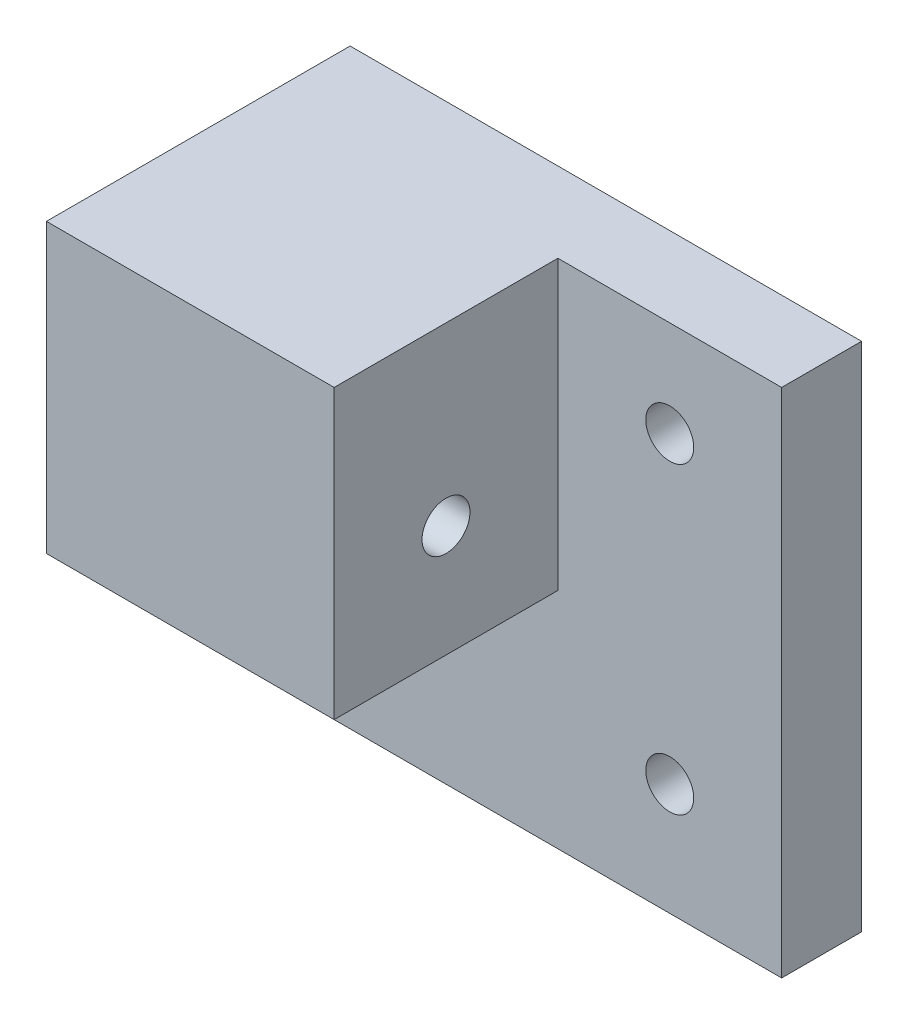
ISO-10303-21;
HEADER;
FILE_DESCRIPTION(('STEP AP214'),'2;1');
FILE_NAME('part.step','',(''),(''),'','','');
FILE_SCHEMA(('AUTOMOTIVE_DESIGN { 1 0 10303 214 1 1 1 1 }'));
ENDSEC;
DATA;
#1=APPLICATION_CONTEXT('core data for automotive mechanical design processes');
#2=APPLICATION_PROTOCOL_DEFINITION('international standard','automotive_design',2000,#1);
#3=PRODUCT_CONTEXT('',#1,'mechanical');
#4=PRODUCT('Part','Part','',(#3));
#5=PRODUCT_RELATED_PRODUCT_CATEGORY('part','',(#4));
#6=PRODUCT_DEFINITION_FORMATION('','',#4);
#7=PRODUCT_DEFINITION_CONTEXT('part definition',#1,'design');
#8=PRODUCT_DEFINITION('design','',#6,#7);
#9=PRODUCT_DEFINITION_SHAPE('','',#8);
#10=(LENGTH_UNIT() NAMED_UNIT(*) SI_UNIT(.MILLI.,.METRE.));
#11=(NAMED_UNIT(*) PLANE_ANGLE_UNIT() SI_UNIT($,.RADIAN.));
#12=(NAMED_UNIT(*) SI_UNIT($,.STERADIAN.) SOLID_ANGLE_UNIT());
#13=UNCERTAINTY_MEASURE_WITH_UNIT(LENGTH_MEASURE(1.E-05),#10,'distance_accuracy_value','');
#14=(GEOMETRIC_REPRESENTATION_CONTEXT(3) GLOBAL_UNCERTAINTY_ASSIGNED_CONTEXT((#13)) GLOBAL_UNIT_ASSIGNED_CONTEXT((#10,
#11,#12)) REPRESENTATION_CONTEXT('',''));
#15=CARTESIAN_POINT('',(0.,0.,0.));
#16=DIRECTION('',(0.,0.,1.));
#17=DIRECTION('',(1.,0.,0.));
#18=AXIS2_PLACEMENT_3D('',#15,#16,#17);
#19=CARTESIAN_POINT('',(-42.,-16.,24.));
#20=DIRECTION('',(0.,-1.,0.));
#21=DIRECTION('',(0.,0.,-1.));
#22=AXIS2_PLACEMENT_3D('',#19,#20,#21);
#23=CYLINDRICAL_SURFACE('',#22,3.);
#24=CARTESIAN_POINT('',(-42.,-36.,24.));
#25=DIRECTION('',(0.,-1.,0.));
#26=DIRECTION('',(0.,0.,-1.));
#27=AXIS2_PLACEMENT_3D('',#24,#25,#26);
#28=CIRCLE('',#27,3.);
#29=CARTESIAN_POINT('',(-42.,-36.,21.));
#30=VERTEX_POINT('',#29);
#31=EDGE_CURVE('E165',#30,#30,#28,.T.);
#32=ORIENTED_EDGE('',*,*,#31,.T.);
#33=EDGE_LOOP('',(#32));
#34=FACE_BOUND('',#33,.T.);
#35=CARTESIAN_POINT('',(-42.,-22.,24.));
#36=DIRECTION('',(-0.707106781186547,-0.707106781186548,0.));
#37=DIRECTION('',(0.707106781186548,-0.707106781186547,0.));
#38=AXIS2_PLACEMENT_3D('',#35,#36,#37);
#39=ELLIPSE('',#38,4.24264068711929,3.);
#40=CARTESIAN_POINT('',(-42.,-22.,27.));
#41=VERTEX_POINT('',#40);
#42=CARTESIAN_POINT('',(-42.,-22.,21.));
#43=VERTEX_POINT('',#42);
#44=EDGE_CURVE('E48',#41,#43,#39,.F.);
#45=ORIENTED_EDGE('',*,*,#44,.T.);
#46=CARTESIAN_POINT('',(-42.,-22.,24.));
#47=DIRECTION('',(0.707106781186548,-0.707106781186547,0.));
#48=DIRECTION('',(-0.707106781186547,-0.707106781186548,0.));
#49=AXIS2_PLACEMENT_3D('',#46,#47,#48);
#50=ELLIPSE('',#49,4.24264068711929,3.);
#51=EDGE_CURVE('E11',#43,#41,#50,.F.);
#52=ORIENTED_EDGE('',*,*,#51,.T.);
#53=EDGE_LOOP('',(#45,#52));
#54=FACE_BOUND('',#53,.T.);
#55=ADVANCED_FACE('F35',(#34,#54),#23,.F.);
#56=CARTESIAN_POINT('',(0.,0.,10.));
#57=DIRECTION('',(0.,0.,-1.));
#58=DIRECTION('',(-1.,0.,0.));
#59=AXIS2_PLACEMENT_3D('',#56,#57,#58);
#60=PLANE('',#59);
#61=CARTESIAN_POINT('',(-52.,-50.,10.));
#62=DIRECTION('',(0.,0.,1.));
#63=DIRECTION('',(1.,0.,0.));
#64=AXIS2_PLACEMENT_3D('',#61,#62,#63);
#65=CIRCLE('',#64,3.);
#66=CARTESIAN_POINT('',(-49.,-50.,10.));
#67=VERTEX_POINT('',#66);
#68=EDGE_CURVE('E183',#67,#67,#65,.T.);
#69=ORIENTED_EDGE('',*,*,#68,.F.);
#70=EDGE_LOOP('',(#69));
#71=FACE_BOUND('',#70,.T.);
#72=CARTESIAN_POINT('',(-14.,-12.,10.));
#73=DIRECTION('',(0.,0.,1.));
#74=DIRECTION('',(1.,0.,0.));
#75=AXIS2_PLACEMENT_3D('',#72,#73,#74);
#76=CIRCLE('',#75,3.);
#77=CARTESIAN_POINT('',(-11.,-12.,10.));
#78=VERTEX_POINT('',#77);
#79=EDGE_CURVE('E189',#78,#78,#76,.T.);
#80=ORIENTED_EDGE('',*,*,#79,.F.);
#81=EDGE_LOOP('',(#80));
#82=FACE_BOUND('',#81,.T.);
#83=CARTESIAN_POINT('',(-14.,-50.,10.));
#84=DIRECTION('',(0.,0.,1.));
#85=DIRECTION('',(1.,0.,0.));
#86=AXIS2_PLACEMENT_3D('',#83,#84,#85);
#87=CIRCLE('',#86,3.);
#88=CARTESIAN_POINT('',(-11.,-50.,10.));
#89=VERTEX_POINT('',#88);
#90=EDGE_CURVE('E177',#89,#89,#87,.T.);
#91=ORIENTED_EDGE('',*,*,#90,.F.);
#92=EDGE_LOOP('',(#91));
#93=FACE_BOUND('',#92,.T.);
#94=DIRECTION('',(0.,1.,0.));
#95=VECTOR('',#94,1.);
#96=CARTESIAN_POINT('',(-28.,0.,10.));
#97=LINE('',#96,#95);
#98=CARTESIAN_POINT('',(-28.,-36.,10.));
#99=VERTEX_POINT('',#98);
#100=CARTESIAN_POINT('',(-28.,0.,10.));
#101=VERTEX_POINT('',#100);
#102=EDGE_CURVE('E151',#99,#101,#97,.T.);
#103=ORIENTED_EDGE('',*,*,#102,.F.);
#104=DIRECTION('',(1.,0.,0.));
#105=VECTOR('',#104,1.);
#106=CARTESIAN_POINT('',(-64.,-36.,10.));
#107=LINE('',#106,#105);
#108=CARTESIAN_POINT('',(-64.,-36.,10.));
#109=VERTEX_POINT('',#108);
#110=EDGE_CURVE('E56',#109,#99,#107,.T.);
#111=ORIENTED_EDGE('',*,*,#110,.F.);
#112=DIRECTION('',(0.,-1.,0.));
#113=VECTOR('',#112,1.);
#114=CARTESIAN_POINT('',(-64.,0.,10.));
#115=LINE('',#114,#113);
#116=CARTESIAN_POINT('',(-64.,-64.,10.));
#117=VERTEX_POINT('',#116);
#118=EDGE_CURVE('E136',#109,#117,#115,.T.);
#119=ORIENTED_EDGE('',*,*,#118,.T.);
#120=DIRECTION('',(1.,0.,0.));
#121=VECTOR('',#120,1.);
#122=CARTESIAN_POINT('',(0.,-64.,10.));
#123=LINE('',#122,#121);
#124=CARTESIAN_POINT('',(0.,-64.,10.));
#125=VERTEX_POINT('',#124);
#126=EDGE_CURVE('E123',#117,#125,#123,.T.);
#127=ORIENTED_EDGE('',*,*,#126,.T.);
#128=DIRECTION('',(0.,1.,0.));
#129=VECTOR('',#128,1.);
#130=CARTESIAN_POINT('',(0.,0.,10.));
#131=LINE('',#130,#129);
#132=CARTESIAN_POINT('',(0.,0.,10.));
#133=VERTEX_POINT('',#132);
#134=EDGE_CURVE('E126',#125,#133,#131,.T.);
#135=ORIENTED_EDGE('',*,*,#134,.T.);
#136=DIRECTION('',(-1.,0.,0.));
#137=VECTOR('',#136,1.);
#138=CARTESIAN_POINT('',(0.,0.,10.));
#139=LINE('',#138,#137);
#140=EDGE_CURVE('E138',#133,#101,#139,.T.);
#141=ORIENTED_EDGE('',*,*,#140,.T.);
#142=EDGE_LOOP('',(#103,#111,#119,#127,#135,#141));
#143=FACE_BOUND('',#142,.T.);
#144=ADVANCED_FACE('F206',(#71,#82,#93,#143),#60,.F.);
#145=CARTESIAN_POINT('',(0.,0.,10.));
#146=DIRECTION('',(-1.,0.,0.));
#147=DIRECTION('',(0.,-1.,0.));
#148=AXIS2_PLACEMENT_3D('',#145,#146,#147);
#149=PLANE('',#148);
#150=DIRECTION('',(0.,1.,0.));
#151=VECTOR('',#150,1.);
#152=CARTESIAN_POINT('',(0.,0.,0.));
#153=LINE('',#152,#151);
#154=CARTESIAN_POINT('',(0.,-64.,0.));
#155=VERTEX_POINT('',#154);
#156=CARTESIAN_POINT('',(0.,0.,0.));
#157=VERTEX_POINT('',#156);
#158=EDGE_CURVE('E131',#155,#157,#153,.T.);
#159=ORIENTED_EDGE('',*,*,#158,.T.);
#160=DIRECTION('',(0.,0.,-1.));
#161=VECTOR('',#160,1.);
#162=CARTESIAN_POINT('',(0.,0.,10.));
#163=LINE('',#162,#161);
#164=EDGE_CURVE('E107',#133,#157,#163,.T.);
#165=ORIENTED_EDGE('',*,*,#164,.F.);
#166=ORIENTED_EDGE('',*,*,#134,.F.);
#167=DIRECTION('',(0.,0.,-1.));
#168=VECTOR('',#167,1.);
#169=CARTESIAN_POINT('',(0.,-64.,10.));
#170=LINE('',#169,#168);
#171=EDGE_CURVE('E120',#125,#155,#170,.T.);
#172=ORIENTED_EDGE('',*,*,#171,.T.);
#173=EDGE_LOOP('',(#159,#165,#166,#172));
#174=FACE_BOUND('',#173,.T.);
#175=ADVANCED_FACE('F37',(#174),#149,.F.);
#176=CARTESIAN_POINT('',(0.,0.,10.));
#177=DIRECTION('',(0.,-1.,0.));
#178=DIRECTION('',(1.,0.,0.));
#179=AXIS2_PLACEMENT_3D('',#176,#177,#178);
#180=PLANE('',#179);
#181=DIRECTION('',(-1.,0.,0.));
#182=VECTOR('',#181,1.);
#183=CARTESIAN_POINT('',(0.,0.,0.));
#184=LINE('',#183,#182);
#185=CARTESIAN_POINT('',(-64.,0.,0.));
#186=VERTEX_POINT('',#185);
#187=EDGE_CURVE('E129',#157,#186,#184,.T.);
#188=ORIENTED_EDGE('',*,*,#187,.T.);
#189=DIRECTION('',(0.,0.,-1.));
#190=VECTOR('',#189,1.);
#191=CARTESIAN_POINT('',(-64.,0.,10.));
#192=LINE('',#191,#190);
#193=CARTESIAN_POINT('',(-64.,0.,38.));
#194=VERTEX_POINT('',#193);
#195=EDGE_CURVE('E114',#194,#186,#192,.T.);
#196=ORIENTED_EDGE('',*,*,#195,.F.);
#197=DIRECTION('',(-1.,0.,0.));
#198=VECTOR('',#197,1.);
#199=CARTESIAN_POINT('',(-64.,0.,38.));
#200=LINE('',#199,#198);
#201=CARTESIAN_POINT('',(-28.,0.,38.));
#202=VERTEX_POINT('',#201);
#203=EDGE_CURVE('E150',#202,#194,#200,.T.);
#204=ORIENTED_EDGE('',*,*,#203,.F.);
#205=DIRECTION('',(0.,0.,-1.));
#206=VECTOR('',#205,1.);
#207=CARTESIAN_POINT('',(-28.,0.,38.));
#208=LINE('',#207,#206);
#209=EDGE_CURVE('E147',#202,#101,#208,.T.);
#210=ORIENTED_EDGE('',*,*,#209,.T.);
#211=ORIENTED_EDGE('',*,*,#140,.F.);
#212=ORIENTED_EDGE('',*,*,#164,.T.);
#213=EDGE_LOOP('',(#188,#196,#204,#210,#211,#212));
#214=FACE_BOUND('',#213,.T.);
#215=ADVANCED_FACE('F237',(#214),#180,.F.);
#216=CARTESIAN_POINT('',(-64.,0.,10.));
#217=DIRECTION('',(1.,0.,0.));
#218=DIRECTION('',(0.,1.,0.));
#219=AXIS2_PLACEMENT_3D('',#216,#217,#218);
#220=PLANE('',#219);
#221=DIRECTION('',(0.,-1.,0.));
#222=VECTOR('',#221,1.);
#223=CARTESIAN_POINT('',(-64.,0.,0.));
#224=LINE('',#223,#222);
#225=CARTESIAN_POINT('',(-64.,-64.,0.));
#226=VERTEX_POINT('',#225);
#227=EDGE_CURVE('E127',#186,#226,#224,.T.);
#228=ORIENTED_EDGE('',*,*,#227,.T.);
#229=DIRECTION('',(0.,0.,-1.));
#230=VECTOR('',#229,1.);
#231=CARTESIAN_POINT('',(-64.,-64.,10.));
#232=LINE('',#231,#230);
#233=EDGE_CURVE('E117',#117,#226,#232,.T.);
#234=ORIENTED_EDGE('',*,*,#233,.F.);
#235=ORIENTED_EDGE('',*,*,#118,.F.);
#236=DIRECTION('',(0.,0.,-1.));
#237=VECTOR('',#236,1.);
#238=CARTESIAN_POINT('',(-64.,-36.,38.));
#239=LINE('',#238,#237);
#240=CARTESIAN_POINT('',(-64.,-36.,38.));
#241=VERTEX_POINT('',#240);
#242=EDGE_CURVE('E134',#241,#109,#239,.T.);
#243=ORIENTED_EDGE('',*,*,#242,.F.);
#244=DIRECTION('',(0.,-1.,0.));
#245=VECTOR('',#244,1.);
#246=CARTESIAN_POINT('',(-64.,0.,38.));
#247=LINE('',#246,#245);
#248=EDGE_CURVE('E154',#194,#241,#247,.T.);
#249=ORIENTED_EDGE('',*,*,#248,.F.);
#250=ORIENTED_EDGE('',*,*,#195,.T.);
#251=EDGE_LOOP('',(#228,#234,#235,#243,#249,#250));
#252=FACE_BOUND('',#251,.T.);
#253=ADVANCED_FACE('F225',(#252),#220,.F.);
#254=CARTESIAN_POINT('',(0.,-64.,10.));
#255=DIRECTION('',(0.,1.,0.));
#256=DIRECTION('',(-1.,0.,0.));
#257=AXIS2_PLACEMENT_3D('',#254,#255,#256);
#258=PLANE('',#257);
#259=DIRECTION('',(1.,0.,0.));
#260=VECTOR('',#259,1.);
#261=CARTESIAN_POINT('',(0.,-64.,0.));
#262=LINE('',#261,#260);
#263=EDGE_CURVE('E124',#226,#155,#262,.T.);
#264=ORIENTED_EDGE('',*,*,#263,.T.);
#265=ORIENTED_EDGE('',*,*,#171,.F.);
#266=ORIENTED_EDGE('',*,*,#126,.F.);
#267=ORIENTED_EDGE('',*,*,#233,.T.);
#268=EDGE_LOOP('',(#264,#265,#266,#267));
#269=FACE_BOUND('',#268,.T.);
#270=ADVANCED_FACE('F232',(#269),#258,.F.);
#271=CARTESIAN_POINT('',(0.,0.,0.));
#272=DIRECTION('',(0.,0.,-1.));
#273=DIRECTION('',(-1.,0.,0.));
#274=AXIS2_PLACEMENT_3D('',#271,#272,#273);
#275=PLANE('',#274);
#276=CARTESIAN_POINT('',(-52.,-50.,0.));
#277=DIRECTION('',(0.,0.,1.));
#278=DIRECTION('',(1.,0.,0.));
#279=AXIS2_PLACEMENT_3D('',#276,#277,#278);
#280=CIRCLE('',#279,3.);
#281=CARTESIAN_POINT('',(-49.,-50.,0.));
#282=VERTEX_POINT('',#281);
#283=EDGE_CURVE('E186',#282,#282,#280,.T.);
#284=ORIENTED_EDGE('',*,*,#283,.T.);
#285=EDGE_LOOP('',(#284));
#286=FACE_BOUND('',#285,.T.);
#287=CARTESIAN_POINT('',(-14.,-12.,0.));
#288=DIRECTION('',(0.,0.,1.));
#289=DIRECTION('',(1.,0.,0.));
#290=AXIS2_PLACEMENT_3D('',#287,#288,#289);
#291=CIRCLE('',#290,3.);
#292=CARTESIAN_POINT('',(-11.,-12.,0.));
#293=VERTEX_POINT('',#292);
#294=EDGE_CURVE('E180',#293,#293,#291,.T.);
#295=ORIENTED_EDGE('',*,*,#294,.T.);
#296=EDGE_LOOP('',(#295));
#297=FACE_BOUND('',#296,.T.);
#298=CARTESIAN_POINT('',(-14.,-50.,0.));
#299=DIRECTION('',(0.,0.,1.));
#300=DIRECTION('',(1.,0.,0.));
#301=AXIS2_PLACEMENT_3D('',#298,#299,#300);
#302=CIRCLE('',#301,3.);
#303=CARTESIAN_POINT('',(-11.,-50.,0.));
#304=VERTEX_POINT('',#303);
#305=EDGE_CURVE('E174',#304,#304,#302,.T.);
#306=ORIENTED_EDGE('',*,*,#305,.T.);
#307=EDGE_LOOP('',(#306));
#308=FACE_BOUND('',#307,.T.);
#309=ORIENTED_EDGE('',*,*,#158,.F.);
#310=ORIENTED_EDGE('',*,*,#263,.F.);
#311=ORIENTED_EDGE('',*,*,#227,.F.);
#312=ORIENTED_EDGE('',*,*,#187,.F.);
#313=EDGE_LOOP('',(#309,#310,#311,#312));
#314=FACE_BOUND('',#313,.T.);
#315=ADVANCED_FACE('F195',(#286,#297,#308,#314),#275,.T.);
#316=CARTESIAN_POINT('',(-64.,-36.,38.));
#317=DIRECTION('',(0.,1.,0.));
#318=DIRECTION('',(0.,0.,1.));
#319=AXIS2_PLACEMENT_3D('',#316,#317,#318);
#320=PLANE('',#319);
#321=ORIENTED_EDGE('',*,*,#31,.F.);
#322=EDGE_LOOP('',(#321));
#323=FACE_BOUND('',#322,.T.);
#324=ORIENTED_EDGE('',*,*,#110,.T.);
#325=DIRECTION('',(0.,0.,-1.));
#326=VECTOR('',#325,1.);
#327=CARTESIAN_POINT('',(-28.,-36.,38.));
#328=LINE('',#327,#326);
#329=CARTESIAN_POINT('',(-28.,-36.,38.));
#330=VERTEX_POINT('',#329);
#331=EDGE_CURVE('E144',#330,#99,#328,.T.);
#332=ORIENTED_EDGE('',*,*,#331,.F.);
#333=DIRECTION('',(1.,0.,0.));
#334=VECTOR('',#333,1.);
#335=CARTESIAN_POINT('',(-64.,-36.,38.));
#336=LINE('',#335,#334);
#337=EDGE_CURVE('E161',#241,#330,#336,.T.);
#338=ORIENTED_EDGE('',*,*,#337,.F.);
#339=ORIENTED_EDGE('',*,*,#242,.T.);
#340=EDGE_LOOP('',(#324,#332,#338,#339));
#341=FACE_BOUND('',#340,.T.);
#342=ADVANCED_FACE('F216',(#323,#341),#320,.F.);
#343=CARTESIAN_POINT('',(-28.,0.,38.));
#344=DIRECTION('',(-1.,0.,0.));
#345=DIRECTION('',(0.,-1.,0.));
#346=AXIS2_PLACEMENT_3D('',#343,#344,#345);
#347=PLANE('',#346);
#348=CARTESIAN_POINT('',(-28.,-22.,24.));
#349=DIRECTION('',(1.,0.,0.));
#350=DIRECTION('',(0.,1.,0.));
#351=AXIS2_PLACEMENT_3D('',#348,#349,#350);
#352=CIRCLE('',#351,3.);
#353=CARTESIAN_POINT('',(-28.,-19.,24.));
#354=VERTEX_POINT('',#353);
#355=EDGE_CURVE('E171',#354,#354,#352,.T.);
#356=ORIENTED_EDGE('',*,*,#355,.F.);
#357=EDGE_LOOP('',(#356));
#358=FACE_BOUND('',#357,.T.);
#359=ORIENTED_EDGE('',*,*,#102,.T.);
#360=ORIENTED_EDGE('',*,*,#209,.F.);
#361=DIRECTION('',(0.,1.,0.));
#362=VECTOR('',#361,1.);
#363=CARTESIAN_POINT('',(-28.,0.,38.));
#364=LINE('',#363,#362);
#365=EDGE_CURVE('E159',#330,#202,#364,.T.);
#366=ORIENTED_EDGE('',*,*,#365,.F.);
#367=ORIENTED_EDGE('',*,*,#331,.T.);
#368=EDGE_LOOP('',(#359,#360,#366,#367));
#369=FACE_BOUND('',#368,.T.);
#370=ADVANCED_FACE('F219',(#358,#369),#347,.F.);
#371=CARTESIAN_POINT('',(0.,0.,38.));
#372=DIRECTION('',(0.,0.,1.));
#373=DIRECTION('',(1.,0.,0.));
#374=AXIS2_PLACEMENT_3D('',#371,#372,#373);
#375=PLANE('',#374);
#376=ORIENTED_EDGE('',*,*,#248,.T.);
#377=ORIENTED_EDGE('',*,*,#337,.T.);
#378=ORIENTED_EDGE('',*,*,#365,.T.);
#379=ORIENTED_EDGE('',*,*,#203,.T.);
#380=EDGE_LOOP('',(#376,#377,#378,#379));
#381=FACE_BOUND('',#380,.T.);
#382=ADVANCED_FACE('F222',(#381),#375,.T.);
#383=CARTESIAN_POINT('',(-48.,-22.,24.));
#384=DIRECTION('',(1.,0.,0.));
#385=DIRECTION('',(0.,1.,0.));
#386=AXIS2_PLACEMENT_3D('',#383,#384,#385);
#387=CYLINDRICAL_SURFACE('',#386,3.);
#388=ORIENTED_EDGE('',*,*,#355,.T.);
#389=EDGE_LOOP('',(#388));
#390=FACE_BOUND('',#389,.T.);
#391=ORIENTED_EDGE('',*,*,#44,.F.);
#392=CARTESIAN_POINT('',(-42.,-22.,24.));
#393=DIRECTION('',(0.707106781186548,-0.707106781186547,0.));
#394=DIRECTION('',(-0.707106781186547,-0.707106781186548,0.));
#395=AXIS2_PLACEMENT_3D('',#392,#393,#394);
#396=ELLIPSE('',#395,4.24264068711929,3.);
#397=EDGE_CURVE('E43',#43,#41,#396,.T.);
#398=ORIENTED_EDGE('',*,*,#397,.F.);
#399=EDGE_LOOP('',(#391,#398));
#400=FACE_BOUND('',#399,.T.);
#401=ADVANCED_FACE('F106',(#390,#400),#387,.F.);
#402=CARTESIAN_POINT('',(-42.,-16.,24.));
#403=DIRECTION('',(0.,-1.,0.));
#404=DIRECTION('',(0.,0.,-1.));
#405=AXIS2_PLACEMENT_3D('',#402,#403,#404);
#406=PLANE('',#405);
#407=CARTESIAN_POINT('',(-42.,-16.,24.));
#408=DIRECTION('',(0.,-1.,0.));
#409=DIRECTION('',(0.,0.,-1.));
#410=AXIS2_PLACEMENT_3D('',#407,#408,#409);
#411=CIRCLE('',#410,3.);
#412=CARTESIAN_POINT('',(-42.,-16.,21.));
#413=VERTEX_POINT('',#412);
#414=EDGE_CURVE('E156',#413,#413,#411,.T.);
#415=ORIENTED_EDGE('',*,*,#414,.T.);
#416=EDGE_LOOP('',(#415));
#417=FACE_BOUND('',#416,.T.);
#418=ADVANCED_FACE('F258',(#417),#406,.T.);
#419=CARTESIAN_POINT('',(-42.,-22.,24.));
#420=DIRECTION('',(-0.707106781186547,-0.707106781186548,0.));
#421=DIRECTION('',(0.707106781186548,-0.707106781186547,0.));
#422=AXIS2_PLACEMENT_3D('',#419,#420,#421);
#423=ELLIPSE('',#422,4.24264068711929,3.);
#424=EDGE_CURVE('E100',#41,#43,#423,.T.);
#425=ORIENTED_EDGE('',*,*,#424,.T.);
#426=ORIENTED_EDGE('',*,*,#397,.T.);
#427=EDGE_LOOP('',(#425,#426));
#428=FACE_BOUND('',#427,.T.);
#429=ORIENTED_EDGE('',*,*,#414,.F.);
#430=EDGE_LOOP('',(#429));
#431=FACE_BOUND('',#430,.T.);
#432=ADVANCED_FACE('F109',(#428,#431),#23,.F.);
#433=CARTESIAN_POINT('',(-48.,-22.,24.));
#434=DIRECTION('',(1.,0.,0.));
#435=DIRECTION('',(0.,1.,0.));
#436=AXIS2_PLACEMENT_3D('',#433,#434,#435);
#437=CIRCLE('',#436,3.);
#438=CARTESIAN_POINT('',(-48.,-19.,24.));
#439=VERTEX_POINT('',#438);
#440=EDGE_CURVE('E168',#439,#439,#437,.T.);
#441=ORIENTED_EDGE('',*,*,#440,.F.);
#442=EDGE_LOOP('',(#441));
#443=FACE_BOUND('',#442,.T.);
#444=ORIENTED_EDGE('',*,*,#424,.F.);
#445=ORIENTED_EDGE('',*,*,#51,.F.);
#446=EDGE_LOOP('',(#444,#445));
#447=FACE_BOUND('',#446,.T.);
#448=ADVANCED_FACE('F101',(#443,#447),#387,.F.);
#449=CARTESIAN_POINT('',(-48.,-22.,24.));
#450=DIRECTION('',(1.,0.,0.));
#451=DIRECTION('',(0.,1.,0.));
#452=AXIS2_PLACEMENT_3D('',#449,#450,#451);
#453=PLANE('',#452);
#454=ORIENTED_EDGE('',*,*,#440,.T.);
#455=EDGE_LOOP('',(#454));
#456=FACE_BOUND('',#455,.T.);
#457=ADVANCED_FACE('F263',(#456),#453,.T.);
#458=CARTESIAN_POINT('',(-14.,-50.,0.));
#459=DIRECTION('',(0.,0.,1.));
#460=DIRECTION('',(1.,0.,0.));
#461=AXIS2_PLACEMENT_3D('',#458,#459,#460);
#462=CYLINDRICAL_SURFACE('',#461,3.);
#463=ORIENTED_EDGE('',*,*,#305,.F.);
#464=EDGE_LOOP('',(#463));
#465=FACE_BOUND('',#464,.T.);
#466=ORIENTED_EDGE('',*,*,#90,.T.);
#467=EDGE_LOOP('',(#466));
#468=FACE_BOUND('',#467,.T.);
#469=ADVANCED_FACE('F202',(#465,#468),#462,.F.);
#470=CARTESIAN_POINT('',(-14.,-12.,0.));
#471=DIRECTION('',(0.,0.,1.));
#472=DIRECTION('',(1.,0.,0.));
#473=AXIS2_PLACEMENT_3D('',#470,#471,#472);
#474=CYLINDRICAL_SURFACE('',#473,3.);
#475=ORIENTED_EDGE('',*,*,#294,.F.);
#476=EDGE_LOOP('',(#475));
#477=FACE_BOUND('',#476,.T.);
#478=ORIENTED_EDGE('',*,*,#79,.T.);
#479=EDGE_LOOP('',(#478));
#480=FACE_BOUND('',#479,.T.);
#481=ADVANCED_FACE('F198',(#477,#480),#474,.F.);
#482=CARTESIAN_POINT('',(-52.,-50.,0.));
#483=DIRECTION('',(0.,0.,1.));
#484=DIRECTION('',(1.,0.,0.));
#485=AXIS2_PLACEMENT_3D('',#482,#483,#484);
#486=CYLINDRICAL_SURFACE('',#485,3.);
#487=ORIENTED_EDGE('',*,*,#283,.F.);
#488=EDGE_LOOP('',(#487));
#489=FACE_BOUND('',#488,.T.);
#490=ORIENTED_EDGE('',*,*,#68,.T.);
#491=EDGE_LOOP('',(#490));
#492=FACE_BOUND('',#491,.T.);
#493=ADVANCED_FACE('F201',(#489,#492),#486,.F.);
#494=CLOSED_SHELL('',(#55,#144,#175,#215,#253,#270,#315,#342,#370,#382,#401,#418,#432,#448,#457,
#469,#481,#493));
#495=MANIFOLD_SOLID_BREP('B2',#494);
#496=ADVANCED_BREP_SHAPE_REPRESENTATION('',(#18,#495),#14);
#497=SHAPE_DEFINITION_REPRESENTATION(#9,#496);
ENDSEC;
END-ISO-10303-21;
